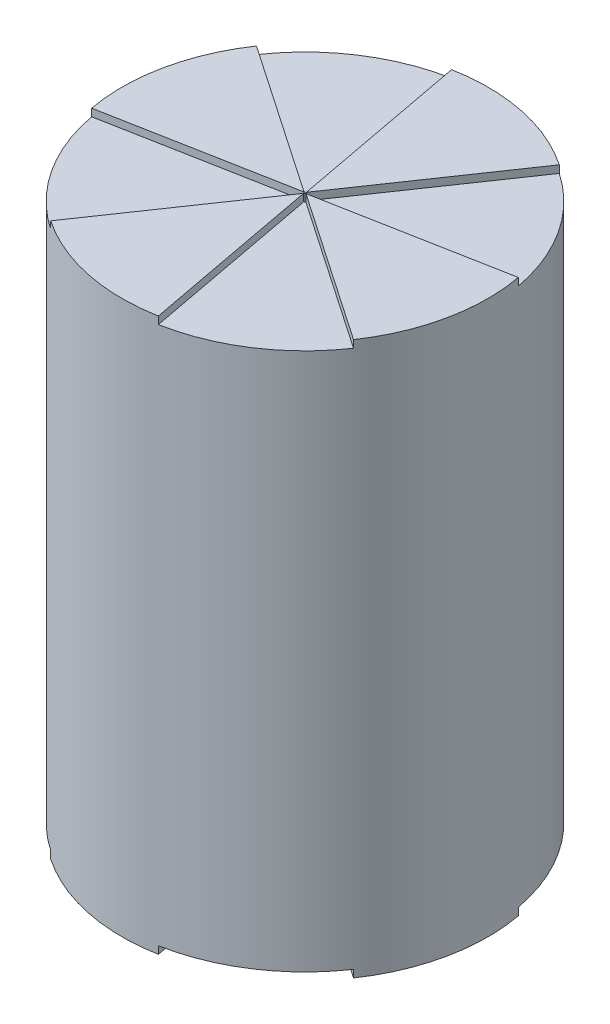
ISO-10303-21;
HEADER;
FILE_DESCRIPTION(('STEP AP214'),'2;1');
FILE_NAME('part.step','',(''),(''),'','','');
FILE_SCHEMA(('AUTOMOTIVE_DESIGN { 1 0 10303 214 1 1 1 1 }'));
ENDSEC;
DATA;
#1=APPLICATION_CONTEXT('core data for automotive mechanical design processes');
#2=APPLICATION_PROTOCOL_DEFINITION('international standard','automotive_design',2000,#1);
#3=PRODUCT_CONTEXT('',#1,'mechanical');
#4=PRODUCT('Part','Part','',(#3));
#5=PRODUCT_RELATED_PRODUCT_CATEGORY('part','',(#4));
#6=PRODUCT_DEFINITION_FORMATION('','',#4);
#7=PRODUCT_DEFINITION_CONTEXT('part definition',#1,'design');
#8=PRODUCT_DEFINITION('design','',#6,#7);
#9=PRODUCT_DEFINITION_SHAPE('','',#8);
#10=(LENGTH_UNIT() NAMED_UNIT(*) SI_UNIT(.MILLI.,.METRE.));
#11=(NAMED_UNIT(*) PLANE_ANGLE_UNIT() SI_UNIT($,.RADIAN.));
#12=(NAMED_UNIT(*) SI_UNIT($,.STERADIAN.) SOLID_ANGLE_UNIT());
#13=UNCERTAINTY_MEASURE_WITH_UNIT(LENGTH_MEASURE(1.E-05),#10,'distance_accuracy_value','');
#14=(GEOMETRIC_REPRESENTATION_CONTEXT(3) GLOBAL_UNCERTAINTY_ASSIGNED_CONTEXT((#13)) GLOBAL_UNIT_ASSIGNED_CONTEXT((#10,
#11,#12)) REPRESENTATION_CONTEXT('',''));
#15=CARTESIAN_POINT('',(0.,0.,0.));
#16=DIRECTION('',(0.,0.,1.));
#17=DIRECTION('',(1.,0.,0.));
#18=AXIS2_PLACEMENT_3D('',#15,#16,#17);
#19=CARTESIAN_POINT('',(0.,187.96,0.));
#20=DIRECTION('',(0.,-1.,0.));
#21=DIRECTION('',(0.,0.,-1.));
#22=AXIS2_PLACEMENT_3D('',#19,#20,#21);
#23=CYLINDRICAL_SURFACE('',#22,62.23);
#24=CARTESIAN_POINT('',(0.,185.42,0.));
#25=DIRECTION('',(0.,1.,0.));
#26=DIRECTION('',(-1.,0.,0.));
#27=AXIS2_PLACEMENT_3D('',#24,#25,#26);
#28=CIRCLE('',#27,62.23);
#29=CARTESIAN_POINT('',(11.3457915218461,185.42,61.1869750416116));
#30=VERTEX_POINT('',#29);
#31=CARTESIAN_POINT('',(51.4696538395341,185.42,34.9778163074617));
#32=VERTEX_POINT('',#31);
#33=EDGE_CURVE('E333',#30,#32,#28,.T.);
#34=ORIENTED_EDGE('',*,*,#33,.F.);
#35=DIRECTION('',(0.,1.,0.));
#36=VECTOR('',#35,1.);
#37=CARTESIAN_POINT('',(11.3457915218461,185.42,61.1869750416116));
#38=LINE('',#37,#36);
#39=CARTESIAN_POINT('',(11.3457915218461,187.96,61.1869750416116));
#40=VERTEX_POINT('',#39);
#41=EDGE_CURVE('E346',#30,#40,#38,.T.);
#42=ORIENTED_EDGE('',*,*,#41,.T.);
#43=CARTESIAN_POINT('',(0.,187.96,0.));
#44=DIRECTION('',(0.,1.,0.));
#45=DIRECTION('',(0.,0.,1.));
#46=AXIS2_PLACEMENT_3D('',#43,#44,#45);
#47=CIRCLE('',#46,62.23);
#48=CARTESIAN_POINT('',(-34.9778163074619,187.96,51.4696538395339));
#49=VERTEX_POINT('',#48);
#50=EDGE_CURVE('E11',#49,#40,#47,.T.);
#51=ORIENTED_EDGE('',*,*,#50,.F.);
#52=DIRECTION('',(0.,1.,0.));
#53=VECTOR('',#52,1.);
#54=CARTESIAN_POINT('',(-34.9778163074619,185.42,51.4696538395339));
#55=LINE('',#54,#53);
#56=CARTESIAN_POINT('',(-34.9778163074619,185.42,51.4696538395339));
#57=VERTEX_POINT('',#56);
#58=EDGE_CURVE('E59',#57,#49,#55,.T.);
#59=ORIENTED_EDGE('',*,*,#58,.F.);
#60=CARTESIAN_POINT('',(0.,185.42,0.));
#61=DIRECTION('',(0.,1.,0.));
#62=DIRECTION('',(0.,0.,-1.));
#63=AXIS2_PLACEMENT_3D('',#60,#61,#62);
#64=CIRCLE('',#63,62.23);
#65=CARTESIAN_POINT('',(-61.1869750416117,185.42,11.3457915218458));
#66=VERTEX_POINT('',#65);
#67=EDGE_CURVE('E357',#66,#57,#64,.T.);
#68=ORIENTED_EDGE('',*,*,#67,.F.);
#69=DIRECTION('',(0.,1.,0.));
#70=VECTOR('',#69,1.);
#71=CARTESIAN_POINT('',(-61.1869750416117,185.42,11.3457915218458));
#72=LINE('',#71,#70);
#73=CARTESIAN_POINT('',(-61.1869750416117,187.96,11.3457915218458));
#74=VERTEX_POINT('',#73);
#75=EDGE_CURVE('E375',#66,#74,#72,.T.);
#76=ORIENTED_EDGE('',*,*,#75,.T.);
#77=CARTESIAN_POINT('',(-51.4696538395343,187.96,-34.9778163074614));
#78=VERTEX_POINT('',#77);
#79=EDGE_CURVE('E44',#78,#74,#47,.T.);
#80=ORIENTED_EDGE('',*,*,#79,.F.);
#81=DIRECTION('',(0.,1.,0.));
#82=VECTOR('',#81,1.);
#83=CARTESIAN_POINT('',(-51.4696538395343,185.42,-34.9778163074614));
#84=LINE('',#83,#82);
#85=CARTESIAN_POINT('',(-51.4696538395343,185.42,-34.9778163074614));
#86=VERTEX_POINT('',#85);
#87=EDGE_CURVE('E303',#86,#78,#84,.T.);
#88=ORIENTED_EDGE('',*,*,#87,.F.);
#89=CARTESIAN_POINT('',(0.,185.42,0.));
#90=DIRECTION('',(0.,1.,0.));
#91=DIRECTION('',(1.,0.,0.));
#92=AXIS2_PLACEMENT_3D('',#89,#90,#91);
#93=CIRCLE('',#92,62.23);
#94=CARTESIAN_POINT('',(-11.3457915218465,185.42,-61.1869750416116));
#95=VERTEX_POINT('',#94);
#96=EDGE_CURVE('E294',#95,#86,#93,.T.);
#97=ORIENTED_EDGE('',*,*,#96,.F.);
#98=DIRECTION('',(0.,1.,0.));
#99=VECTOR('',#98,1.);
#100=CARTESIAN_POINT('',(-11.3457915218465,185.42,-61.1869750416116));
#101=LINE('',#100,#99);
#102=CARTESIAN_POINT('',(-11.3457915218465,187.96,-61.1869750416116));
#103=VERTEX_POINT('',#102);
#104=EDGE_CURVE('E306',#95,#103,#101,.T.);
#105=ORIENTED_EDGE('',*,*,#104,.T.);
#106=CARTESIAN_POINT('',(34.9778163074619,187.96,-51.4696538395339));
#107=VERTEX_POINT('',#106);
#108=EDGE_CURVE('E391',#107,#103,#47,.T.);
#109=ORIENTED_EDGE('',*,*,#108,.F.);
#110=DIRECTION('',(0.,1.,0.));
#111=VECTOR('',#110,1.);
#112=CARTESIAN_POINT('',(34.9778163074619,185.42,-51.4696538395339));
#113=LINE('',#112,#111);
#114=CARTESIAN_POINT('',(34.9778163074619,185.42,-51.4696538395339));
#115=VERTEX_POINT('',#114);
#116=EDGE_CURVE('E322',#115,#107,#113,.T.);
#117=ORIENTED_EDGE('',*,*,#116,.F.);
#118=CARTESIAN_POINT('',(0.,185.42,0.));
#119=DIRECTION('',(0.,1.,0.));
#120=DIRECTION('',(0.,0.,1.));
#121=AXIS2_PLACEMENT_3D('',#118,#119,#120);
#122=CIRCLE('',#121,62.23);
#123=CARTESIAN_POINT('',(61.1869750416117,185.42,-11.3457915218458));
#124=VERTEX_POINT('',#123);
#125=EDGE_CURVE('E313',#124,#115,#122,.T.);
#126=ORIENTED_EDGE('',*,*,#125,.F.);
#127=DIRECTION('',(0.,1.,0.));
#128=VECTOR('',#127,1.);
#129=CARTESIAN_POINT('',(61.1869750416117,185.42,-11.3457915218458));
#130=LINE('',#129,#128);
#131=CARTESIAN_POINT('',(61.1869750416117,187.96,-11.3457915218458));
#132=VERTEX_POINT('',#131);
#133=EDGE_CURVE('E326',#124,#132,#130,.T.);
#134=ORIENTED_EDGE('',*,*,#133,.T.);
#135=CARTESIAN_POINT('',(51.4696538395341,187.96,34.9778163074617));
#136=VERTEX_POINT('',#135);
#137=EDGE_CURVE('E43',#136,#132,#47,.T.);
#138=ORIENTED_EDGE('',*,*,#137,.F.);
#139=DIRECTION('',(0.,1.,0.));
#140=VECTOR('',#139,1.);
#141=CARTESIAN_POINT('',(51.4696538395341,185.42,34.9778163074617));
#142=LINE('',#141,#140);
#143=EDGE_CURVE('E342',#32,#136,#142,.T.);
#144=ORIENTED_EDGE('',*,*,#143,.F.);
#145=EDGE_LOOP('',(#34,#42,#51,#59,#68,#76,#80,#88,#97,#105,#109,#117,#126,#134,#138,#144));
#146=FACE_BOUND('',#145,.T.);
#147=DIRECTION('',(0.,-1.,0.));
#148=VECTOR('',#147,1.);
#149=CARTESIAN_POINT('',(-34.9778163074619,2.54,51.4696538395339));
#150=LINE('',#149,#148);
#151=CARTESIAN_POINT('',(-34.9778163074619,2.54,51.4696538395339));
#152=VERTEX_POINT('',#151);
#153=CARTESIAN_POINT('',(-34.9778163074619,0.,51.4696538395339));
#154=VERTEX_POINT('',#153);
#155=EDGE_CURVE('E290',#152,#154,#150,.T.);
#156=ORIENTED_EDGE('',*,*,#155,.T.);
#157=CARTESIAN_POINT('',(0.,0.,0.));
#158=DIRECTION('',(0.,1.,0.));
#159=DIRECTION('',(0.,0.,1.));
#160=AXIS2_PLACEMENT_3D('',#157,#158,#159);
#161=CIRCLE('',#160,62.23);
#162=CARTESIAN_POINT('',(11.3457915218461,0.,61.1869750416116));
#163=VERTEX_POINT('',#162);
#164=EDGE_CURVE('E38',#154,#163,#161,.T.);
#165=ORIENTED_EDGE('',*,*,#164,.T.);
#166=DIRECTION('',(0.,-1.,0.));
#167=VECTOR('',#166,1.);
#168=CARTESIAN_POINT('',(11.3457915218461,2.54,61.1869750416116));
#169=LINE('',#168,#167);
#170=CARTESIAN_POINT('',(11.3457915218461,2.54,61.1869750416116));
#171=VERTEX_POINT('',#170);
#172=EDGE_CURVE('E254',#171,#163,#169,.T.);
#173=ORIENTED_EDGE('',*,*,#172,.F.);
#174=CARTESIAN_POINT('',(0.,2.54,0.));
#175=DIRECTION('',(0.,1.,0.));
#176=DIRECTION('',(-1.,0.,0.));
#177=AXIS2_PLACEMENT_3D('',#174,#175,#176);
#178=CIRCLE('',#177,62.23);
#179=CARTESIAN_POINT('',(51.4696538395341,2.54,34.9778163074617));
#180=VERTEX_POINT('',#179);
#181=EDGE_CURVE('E245',#171,#180,#178,.T.);
#182=ORIENTED_EDGE('',*,*,#181,.T.);
#183=DIRECTION('',(0.,-1.,0.));
#184=VECTOR('',#183,1.);
#185=CARTESIAN_POINT('',(51.4696538395341,2.54,34.9778163074617));
#186=LINE('',#185,#184);
#187=CARTESIAN_POINT('',(51.4696538395341,0.,34.9778163074617));
#188=VERTEX_POINT('',#187);
#189=EDGE_CURVE('E259',#180,#188,#186,.T.);
#190=ORIENTED_EDGE('',*,*,#189,.T.);
#191=CARTESIAN_POINT('',(61.1869750416117,0.,-11.3457915218458));
#192=VERTEX_POINT('',#191);
#193=EDGE_CURVE('E384',#188,#192,#161,.T.);
#194=ORIENTED_EDGE('',*,*,#193,.T.);
#195=DIRECTION('',(0.,-1.,0.));
#196=VECTOR('',#195,1.);
#197=CARTESIAN_POINT('',(61.1869750416117,2.54,-11.3457915218458));
#198=LINE('',#197,#196);
#199=CARTESIAN_POINT('',(61.1869750416117,2.54,-11.3457915218458));
#200=VERTEX_POINT('',#199);
#201=EDGE_CURVE('E234',#200,#192,#198,.T.);
#202=ORIENTED_EDGE('',*,*,#201,.F.);
#203=CARTESIAN_POINT('',(0.,2.54,0.));
#204=DIRECTION('',(0.,1.,0.));
#205=DIRECTION('',(0.,0.,1.));
#206=AXIS2_PLACEMENT_3D('',#203,#204,#205);
#207=CIRCLE('',#206,62.23);
#208=CARTESIAN_POINT('',(34.9778163074619,2.54,-51.4696538395339));
#209=VERTEX_POINT('',#208);
#210=EDGE_CURVE('E226',#200,#209,#207,.T.);
#211=ORIENTED_EDGE('',*,*,#210,.T.);
#212=DIRECTION('',(0.,-1.,0.));
#213=VECTOR('',#212,1.);
#214=CARTESIAN_POINT('',(34.9778163074619,2.54,-51.4696538395339));
#215=LINE('',#214,#213);
#216=CARTESIAN_POINT('',(34.9778163074619,0.,-51.4696538395339));
#217=VERTEX_POINT('',#216);
#218=EDGE_CURVE('E239',#209,#217,#215,.T.);
#219=ORIENTED_EDGE('',*,*,#218,.T.);
#220=CARTESIAN_POINT('',(-11.3457915218465,0.,-61.1869750416116));
#221=VERTEX_POINT('',#220);
#222=EDGE_CURVE('E218',#217,#221,#161,.T.);
#223=ORIENTED_EDGE('',*,*,#222,.T.);
#224=DIRECTION('',(0.,-1.,0.));
#225=VECTOR('',#224,1.);
#226=CARTESIAN_POINT('',(-11.3457915218465,2.54,-61.1869750416116));
#227=LINE('',#226,#225);
#228=CARTESIAN_POINT('',(-11.3457915218465,2.54,-61.1869750416116));
#229=VERTEX_POINT('',#228);
#230=EDGE_CURVE('E51',#229,#221,#227,.T.);
#231=ORIENTED_EDGE('',*,*,#230,.F.);
#232=CARTESIAN_POINT('',(0.,2.54,0.));
#233=DIRECTION('',(0.,1.,0.));
#234=DIRECTION('',(1.,0.,0.));
#235=AXIS2_PLACEMENT_3D('',#232,#233,#234);
#236=CIRCLE('',#235,62.23);
#237=CARTESIAN_POINT('',(-51.4696538395343,2.54,-34.9778163074614));
#238=VERTEX_POINT('',#237);
#239=EDGE_CURVE('E204',#229,#238,#236,.T.);
#240=ORIENTED_EDGE('',*,*,#239,.T.);
#241=DIRECTION('',(0.,-1.,0.));
#242=VECTOR('',#241,1.);
#243=CARTESIAN_POINT('',(-51.4696538395343,2.54,-34.9778163074614));
#244=LINE('',#243,#242);
#245=CARTESIAN_POINT('',(-51.4696538395343,0.,-34.9778163074614));
#246=VERTEX_POINT('',#245);
#247=EDGE_CURVE('E219',#238,#246,#244,.T.);
#248=ORIENTED_EDGE('',*,*,#247,.T.);
#249=CARTESIAN_POINT('',(-61.1869750416117,0.,11.3457915218458));
#250=VERTEX_POINT('',#249);
#251=EDGE_CURVE('E383',#246,#250,#161,.T.);
#252=ORIENTED_EDGE('',*,*,#251,.T.);
#253=DIRECTION('',(0.,-1.,0.));
#254=VECTOR('',#253,1.);
#255=CARTESIAN_POINT('',(-61.1869750416117,2.54,11.3457915218458));
#256=LINE('',#255,#254);
#257=CARTESIAN_POINT('',(-61.1869750416117,2.54,11.3457915218458));
#258=VERTEX_POINT('',#257);
#259=EDGE_CURVE('E282',#258,#250,#256,.T.);
#260=ORIENTED_EDGE('',*,*,#259,.F.);
#261=CARTESIAN_POINT('',(0.,2.54,0.));
#262=DIRECTION('',(0.,1.,0.));
#263=DIRECTION('',(0.,0.,-1.));
#264=AXIS2_PLACEMENT_3D('',#261,#262,#263);
#265=CIRCLE('',#264,62.23);
#266=EDGE_CURVE('E270',#258,#152,#265,.T.);
#267=ORIENTED_EDGE('',*,*,#266,.T.);
#268=EDGE_LOOP('',(#156,#165,#173,#182,#190,#194,#202,#211,#219,#223,#231,#240,#248,#252,#260,#267));
#269=FACE_BOUND('',#268,.T.);
#270=ADVANCED_FACE('F35',(#146,#269),#23,.T.);
#271=CARTESIAN_POINT('',(0.,0.,0.));
#272=DIRECTION('',(0.,1.,0.));
#273=DIRECTION('',(0.,0.,1.));
#274=AXIS2_PLACEMENT_3D('',#271,#272,#273);
#275=PLANE('',#274);
#276=DIRECTION('',(0.56420608270553,0.,-0.825633996537255));
#277=VECTOR('',#276,1.);
#278=CARTESIAN_POINT('',(-34.9778163074619,0.,51.4696538395339));
#279=LINE('',#278,#277);
#280=CARTESIAN_POINT('',(-0.0861680748122756,0.,0.410773300789611));
#281=VERTEX_POINT('',#280);
#282=EDGE_CURVE('E274',#154,#281,#279,.T.);
#283=ORIENTED_EDGE('',*,*,#282,.T.);
#284=DIRECTION('',(0.184857450661874,0.,0.982765344797421));
#285=VECTOR('',#284,1.);
#286=CARTESIAN_POINT('',(-0.121475110096735,0.,0.223069042287327));
#287=LINE('',#286,#285);
#288=EDGE_CURVE('E244',#281,#163,#287,.T.);
#289=ORIENTED_EDGE('',*,*,#288,.T.);
#290=ORIENTED_EDGE('',*,*,#164,.F.);
#291=EDGE_LOOP('',(#283,#289,#290));
#292=FACE_BOUND('',#291,.T.);
#293=ADVANCED_FACE('F450',(#292),#275,.F.);
#294=DIRECTION('',(-0.982765344797421,0.,0.18485745066187));
#295=VECTOR('',#294,1.);
#296=CARTESIAN_POINT('',(-0.223069042287327,0.,-0.121475110096735));
#297=LINE('',#296,#295);
#298=CARTESIAN_POINT('',(-0.410773300789609,0.,-0.086168074812274));
#299=VERTEX_POINT('',#298);
#300=EDGE_CURVE('E269',#299,#250,#297,.T.);
#301=ORIENTED_EDGE('',*,*,#300,.T.);
#302=ORIENTED_EDGE('',*,*,#251,.F.);
#303=DIRECTION('',(0.825633996537261,0.,0.564206082705522));
#304=VECTOR('',#303,1.);
#305=CARTESIAN_POINT('',(-51.4696538395343,0.,-34.9778163074614));
#306=LINE('',#305,#304);
#307=EDGE_CURVE('E212',#246,#299,#306,.T.);
#308=ORIENTED_EDGE('',*,*,#307,.T.);
#309=EDGE_LOOP('',(#301,#302,#308));
#310=FACE_BOUND('',#309,.T.);
#311=ADVANCED_FACE('F454',(#310),#275,.F.);
#312=DIRECTION('',(-0.825633996537257,0.,-0.564206082705527));
#313=VECTOR('',#312,1.);
#314=CARTESIAN_POINT('',(51.4696538395341,0.,34.9778163074617));
#315=LINE('',#314,#313);
#316=CARTESIAN_POINT('',(0.410773300789592,0.,0.086168074812271));
#317=VERTEX_POINT('',#316);
#318=EDGE_CURVE('E249',#188,#317,#315,.T.);
#319=ORIENTED_EDGE('',*,*,#318,.T.);
#320=DIRECTION('',(0.982765344797421,0.,-0.18485745066187));
#321=VECTOR('',#320,1.);
#322=CARTESIAN_POINT('',(0.223069042287327,0.,0.121475110096735));
#323=LINE('',#322,#321);
#324=EDGE_CURVE('E221',#317,#192,#323,.T.);
#325=ORIENTED_EDGE('',*,*,#324,.T.);
#326=ORIENTED_EDGE('',*,*,#193,.F.);
#327=EDGE_LOOP('',(#319,#325,#326));
#328=FACE_BOUND('',#327,.T.);
#329=ADVANCED_FACE('F460',(#328),#275,.F.);
#330=DIRECTION('',(-0.56420608270553,0.,0.825633996537255));
#331=VECTOR('',#330,1.);
#332=CARTESIAN_POINT('',(34.9778163074619,0.,-51.4696538395339));
#333=LINE('',#332,#331);
#334=CARTESIAN_POINT('',(0.086168074812272,0.,-0.410773300789591));
#335=VERTEX_POINT('',#334);
#336=EDGE_CURVE('E230',#217,#335,#333,.T.);
#337=ORIENTED_EDGE('',*,*,#336,.T.);
#338=DIRECTION('',(-0.184857450661881,0.,-0.982765344797419));
#339=VECTOR('',#338,1.);
#340=CARTESIAN_POINT('',(0.121475110096733,0.,-0.223069042287328));
#341=LINE('',#340,#339);
#342=EDGE_CURVE('E477',#335,#221,#341,.T.);
#343=ORIENTED_EDGE('',*,*,#342,.T.);
#344=ORIENTED_EDGE('',*,*,#222,.F.);
#345=EDGE_LOOP('',(#337,#343,#344));
#346=FACE_BOUND('',#345,.T.);
#347=ADVANCED_FACE('F464',(#346),#275,.F.);
#348=CARTESIAN_POINT('',(0.,187.96,0.));
#349=DIRECTION('',(0.,1.,0.));
#350=DIRECTION('',(0.,0.,1.));
#351=AXIS2_PLACEMENT_3D('',#348,#349,#350);
#352=PLANE('',#351);
#353=DIRECTION('',(0.184857450661874,0.,0.982765344797421));
#354=VECTOR('',#353,1.);
#355=CARTESIAN_POINT('',(-0.121475110096735,187.96,0.223069042287327));
#356=LINE('',#355,#354);
#357=CARTESIAN_POINT('',(-0.0861680748122707,187.96,0.410773300789586));
#358=VERTEX_POINT('',#357);
#359=EDGE_CURVE('E337',#358,#40,#356,.T.);
#360=ORIENTED_EDGE('',*,*,#359,.F.);
#361=DIRECTION('',(0.56420608270553,0.,-0.825633996537255));
#362=VECTOR('',#361,1.);
#363=CARTESIAN_POINT('',(-34.9778163074619,187.96,51.4696538395339));
#364=LINE('',#363,#362);
#365=EDGE_CURVE('E356',#49,#358,#364,.T.);
#366=ORIENTED_EDGE('',*,*,#365,.F.);
#367=ORIENTED_EDGE('',*,*,#50,.T.);
#368=EDGE_LOOP('',(#360,#366,#367));
#369=FACE_BOUND('',#368,.T.);
#370=ADVANCED_FACE('F424',(#369),#352,.T.);
#371=CARTESIAN_POINT('',(0.,187.96,0.));
#372=DIRECTION('',(0.,-1.,0.));
#373=DIRECTION('',(0.,0.,-1.));
#374=AXIS2_PLACEMENT_3D('',#371,#372,#373);
#375=CIRCLE('',#374,0.253999999999998);
#376=CARTESIAN_POINT('',(0.,187.96,-0.253999999999998));
#377=VERTEX_POINT('',#376);
#378=EDGE_CURVE('E370',#377,#377,#375,.T.);
#379=ORIENTED_EDGE('',*,*,#378,.F.);
#380=EDGE_LOOP('',(#379));
#381=FACE_BOUND('',#380,.T.);
#382=ADVANCED_FACE('F447',(#381),#352,.T.);
#383=DIRECTION('',(-0.825633996537257,0.,-0.564206082705527));
#384=VECTOR('',#383,1.);
#385=CARTESIAN_POINT('',(51.4696538395341,187.96,34.9778163074617));
#386=LINE('',#385,#384);
#387=CARTESIAN_POINT('',(0.410773300789593,187.96,0.0861680748122769));
#388=VERTEX_POINT('',#387);
#389=EDGE_CURVE('E332',#136,#388,#386,.T.);
#390=ORIENTED_EDGE('',*,*,#389,.F.);
#391=ORIENTED_EDGE('',*,*,#137,.T.);
#392=DIRECTION('',(0.982765344797421,0.,-0.18485745066187));
#393=VECTOR('',#392,1.);
#394=CARTESIAN_POINT('',(0.223069042287327,187.96,0.121475110096735));
#395=LINE('',#394,#393);
#396=EDGE_CURVE('E317',#388,#132,#395,.T.);
#397=ORIENTED_EDGE('',*,*,#396,.F.);
#398=EDGE_LOOP('',(#390,#391,#397));
#399=FACE_BOUND('',#398,.T.);
#400=ADVANCED_FACE('F405',(#399),#352,.T.);
#401=DIRECTION('',(-0.56420608270553,0.,0.825633996537255));
#402=VECTOR('',#401,1.);
#403=CARTESIAN_POINT('',(34.9778163074619,187.96,-51.4696538395339));
#404=LINE('',#403,#402);
#405=CARTESIAN_POINT('',(0.0861680748122732,187.96,-0.410773300789591));
#406=VERTEX_POINT('',#405);
#407=EDGE_CURVE('E312',#107,#406,#404,.T.);
#408=ORIENTED_EDGE('',*,*,#407,.F.);
#409=ORIENTED_EDGE('',*,*,#108,.T.);
#410=DIRECTION('',(-0.184857450661881,0.,-0.982765344797419));
#411=VECTOR('',#410,1.);
#412=CARTESIAN_POINT('',(0.121475110096733,187.96,-0.223069042287328));
#413=LINE('',#412,#411);
#414=EDGE_CURVE('E298',#406,#103,#413,.T.);
#415=ORIENTED_EDGE('',*,*,#414,.F.);
#416=EDGE_LOOP('',(#408,#409,#415));
#417=FACE_BOUND('',#416,.T.);
#418=ADVANCED_FACE('F440',(#417),#352,.T.);
#419=DIRECTION('',(0.825633996537261,0.,0.564206082705522));
#420=VECTOR('',#419,1.);
#421=CARTESIAN_POINT('',(-51.4696538395343,187.96,-34.9778163074614));
#422=LINE('',#421,#420);
#423=CARTESIAN_POINT('',(-0.410773300789619,187.96,-0.0861680748122789));
#424=VERTEX_POINT('',#423);
#425=EDGE_CURVE('E292',#78,#424,#422,.T.);
#426=ORIENTED_EDGE('',*,*,#425,.F.);
#427=ORIENTED_EDGE('',*,*,#79,.T.);
#428=DIRECTION('',(-0.982765344797421,0.,0.18485745066187));
#429=VECTOR('',#428,1.);
#430=CARTESIAN_POINT('',(-0.223069042287327,187.96,-0.121475110096735));
#431=LINE('',#430,#429);
#432=EDGE_CURVE('E361',#424,#74,#431,.T.);
#433=ORIENTED_EDGE('',*,*,#432,.F.);
#434=EDGE_LOOP('',(#426,#427,#433));
#435=FACE_BOUND('',#434,.T.);
#436=ADVANCED_FACE('F429',(#435),#352,.T.);
#437=CARTESIAN_POINT('',(-0.223069042287327,185.42,-0.121475110096735));
#438=DIRECTION('',(-0.18485745066187,0.,-0.982765344797421));
#439=DIRECTION('',(-0.982765344797421,0.,0.18485745066187));
#440=AXIS2_PLACEMENT_3D('',#437,#438,#439);
#441=PLANE('',#440);
#442=DIRECTION('',(-0.982765344797421,0.,0.18485745066187));
#443=VECTOR('',#442,1.);
#444=CARTESIAN_POINT('',(-0.223069042287327,185.42,-0.121475110096735));
#445=LINE('',#444,#443);
#446=CARTESIAN_POINT('',(-0.410773300789619,185.42,-0.0861680748122789));
#447=VERTEX_POINT('',#446);
#448=EDGE_CURVE('E367',#447,#66,#445,.T.);
#449=ORIENTED_EDGE('',*,*,#448,.F.);
#450=DIRECTION('',(0.,1.,0.));
#451=VECTOR('',#450,1.);
#452=CARTESIAN_POINT('',(-0.41077330078961,185.42,-0.0861680748122737));
#453=LINE('',#452,#451);
#454=EDGE_CURVE('E349',#447,#424,#453,.T.);
#455=ORIENTED_EDGE('',*,*,#454,.T.);
#456=ORIENTED_EDGE('',*,*,#432,.T.);
#457=ORIENTED_EDGE('',*,*,#75,.F.);
#458=EDGE_LOOP('',(#449,#455,#456,#457));
#459=FACE_BOUND('',#458,.T.);
#460=ADVANCED_FACE('F428',(#459),#441,.F.);
#461=CARTESIAN_POINT('',(0.,185.42,0.));
#462=DIRECTION('',(0.,1.,0.));
#463=DIRECTION('',(0.,0.,1.));
#464=AXIS2_PLACEMENT_3D('',#461,#462,#463);
#465=CYLINDRICAL_SURFACE('',#464,0.253999999999998);
#466=ORIENTED_EDGE('',*,*,#378,.T.);
#467=EDGE_LOOP('',(#466));
#468=FACE_BOUND('',#467,.T.);
#469=CARTESIAN_POINT('',(0.,185.42,0.));
#470=DIRECTION('',(0.,-1.,0.));
#471=DIRECTION('',(0.,0.,-1.));
#472=AXIS2_PLACEMENT_3D('',#469,#470,#471);
#473=CIRCLE('',#472,0.253999999999998);
#474=CARTESIAN_POINT('',(0.,185.42,-0.253999999999998));
#475=VERTEX_POINT('',#474);
#476=EDGE_CURVE('E364',#475,#475,#473,.T.);
#477=ORIENTED_EDGE('',*,*,#476,.F.);
#478=EDGE_LOOP('',(#477));
#479=FACE_BOUND('',#478,.T.);
#480=ADVANCED_FACE('F547',(#468,#479),#465,.T.);
#481=CARTESIAN_POINT('',(-34.9778163074619,185.42,51.4696538395339));
#482=DIRECTION('',(0.825633996537255,0.,0.56420608270553));
#483=DIRECTION('',(0.56420608270553,0.,-0.825633996537255));
#484=AXIS2_PLACEMENT_3D('',#481,#482,#483);
#485=PLANE('',#484);
#486=ORIENTED_EDGE('',*,*,#365,.T.);
#487=DIRECTION('',(0.,-1.,0.));
#488=VECTOR('',#487,1.);
#489=CARTESIAN_POINT('',(-0.086168074812272,185.42,0.410773300789605));
#490=LINE('',#489,#488);
#491=CARTESIAN_POINT('',(-0.0861680748122723,185.42,0.41077330078961));
#492=VERTEX_POINT('',#491);
#493=EDGE_CURVE('E353',#358,#492,#490,.T.);
#494=ORIENTED_EDGE('',*,*,#493,.T.);
#495=DIRECTION('',(0.56420608270553,0.,-0.825633996537255));
#496=VECTOR('',#495,1.);
#497=CARTESIAN_POINT('',(-34.9778163074619,185.42,51.4696538395339));
#498=LINE('',#497,#496);
#499=EDGE_CURVE('E360',#57,#492,#498,.T.);
#500=ORIENTED_EDGE('',*,*,#499,.F.);
#501=ORIENTED_EDGE('',*,*,#58,.T.);
#502=EDGE_LOOP('',(#486,#494,#500,#501));
#503=FACE_BOUND('',#502,.T.);
#504=ADVANCED_FACE('F425',(#503),#485,.F.);
#505=CARTESIAN_POINT('',(0.,185.42,0.));
#506=DIRECTION('',(0.,-1.,0.));
#507=DIRECTION('',(0.,0.,-1.));
#508=AXIS2_PLACEMENT_3D('',#505,#506,#507);
#509=PLANE('',#508);
#510=DIRECTION('',(0.825633996537261,0.,0.564206082705522));
#511=VECTOR('',#510,1.);
#512=CARTESIAN_POINT('',(-51.4696538395343,185.42,-34.9778163074614));
#513=LINE('',#512,#511);
#514=EDGE_CURVE('E297',#86,#447,#513,.T.);
#515=ORIENTED_EDGE('',*,*,#514,.T.);
#516=ORIENTED_EDGE('',*,*,#448,.T.);
#517=ORIENTED_EDGE('',*,*,#67,.T.);
#518=ORIENTED_EDGE('',*,*,#499,.T.);
#519=DIRECTION('',(0.184857450661874,0.,0.982765344797421));
#520=VECTOR('',#519,1.);
#521=CARTESIAN_POINT('',(-0.121475110096735,185.42,0.223069042287327));
#522=LINE('',#521,#520);
#523=EDGE_CURVE('E340',#492,#30,#522,.T.);
#524=ORIENTED_EDGE('',*,*,#523,.T.);
#525=ORIENTED_EDGE('',*,*,#33,.T.);
#526=DIRECTION('',(-0.825633996537257,0.,-0.564206082705527));
#527=VECTOR('',#526,1.);
#528=CARTESIAN_POINT('',(51.4696538395341,185.42,34.9778163074617));
#529=LINE('',#528,#527);
#530=CARTESIAN_POINT('',(0.410773300789593,185.42,0.0861680748122769));
#531=VERTEX_POINT('',#530);
#532=EDGE_CURVE('E336',#32,#531,#529,.T.);
#533=ORIENTED_EDGE('',*,*,#532,.T.);
#534=DIRECTION('',(0.982765344797421,0.,-0.18485745066187));
#535=VECTOR('',#534,1.);
#536=CARTESIAN_POINT('',(0.223069042287327,185.42,0.121475110096735));
#537=LINE('',#536,#535);
#538=EDGE_CURVE('E320',#531,#124,#537,.T.);
#539=ORIENTED_EDGE('',*,*,#538,.T.);
#540=ORIENTED_EDGE('',*,*,#125,.T.);
#541=DIRECTION('',(-0.56420608270553,0.,0.825633996537255));
#542=VECTOR('',#541,1.);
#543=CARTESIAN_POINT('',(34.9778163074619,185.42,-51.4696538395339));
#544=LINE('',#543,#542);
#545=CARTESIAN_POINT('',(0.0861680748122732,185.42,-0.410773300789591));
#546=VERTEX_POINT('',#545);
#547=EDGE_CURVE('E316',#115,#546,#544,.T.);
#548=ORIENTED_EDGE('',*,*,#547,.T.);
#549=DIRECTION('',(-0.184857450661881,0.,-0.982765344797419));
#550=VECTOR('',#549,1.);
#551=CARTESIAN_POINT('',(0.121475110096733,185.42,-0.223069042287328));
#552=LINE('',#551,#550);
#553=EDGE_CURVE('E301',#546,#95,#552,.T.);
#554=ORIENTED_EDGE('',*,*,#553,.T.);
#555=ORIENTED_EDGE('',*,*,#96,.T.);
#556=EDGE_LOOP('',(#515,#516,#517,#518,#524,#525,#533,#539,#540,#548,#554,#555));
#557=FACE_BOUND('',#556,.T.);
#558=ORIENTED_EDGE('',*,*,#476,.T.);
#559=EDGE_LOOP('',(#558));
#560=FACE_BOUND('',#559,.T.);
#561=ADVANCED_FACE('F417',(#557,#560),#509,.F.);
#562=CARTESIAN_POINT('',(-0.121475110096735,185.42,0.223069042287327));
#563=DIRECTION('',(-0.98276534479742,0.,0.184857450661874));
#564=DIRECTION('',(0.184857450661874,0.,0.982765344797421));
#565=AXIS2_PLACEMENT_3D('',#562,#563,#564);
#566=PLANE('',#565);
#567=ORIENTED_EDGE('',*,*,#359,.T.);
#568=ORIENTED_EDGE('',*,*,#41,.F.);
#569=ORIENTED_EDGE('',*,*,#523,.F.);
#570=ORIENTED_EDGE('',*,*,#493,.F.);
#571=EDGE_LOOP('',(#567,#568,#569,#570));
#572=FACE_BOUND('',#571,.T.);
#573=ADVANCED_FACE('F534',(#572),#566,.F.);
#574=CARTESIAN_POINT('',(-51.4696538395343,185.42,-34.9778163074614));
#575=DIRECTION('',(-0.564206082705522,0.,0.825633996537261));
#576=DIRECTION('',(0.825633996537261,0.,0.564206082705522));
#577=AXIS2_PLACEMENT_3D('',#574,#575,#576);
#578=PLANE('',#577);
#579=ORIENTED_EDGE('',*,*,#514,.F.);
#580=ORIENTED_EDGE('',*,*,#87,.T.);
#581=ORIENTED_EDGE('',*,*,#425,.T.);
#582=ORIENTED_EDGE('',*,*,#454,.F.);
#583=EDGE_LOOP('',(#579,#580,#581,#582));
#584=FACE_BOUND('',#583,.T.);
#585=ADVANCED_FACE('F433',(#584),#578,.F.);
#586=CARTESIAN_POINT('',(51.4696538395341,185.42,34.9778163074617));
#587=DIRECTION('',(0.564206082705527,0.,-0.825633996537257));
#588=DIRECTION('',(-0.825633996537257,0.,-0.564206082705528));
#589=AXIS2_PLACEMENT_3D('',#586,#587,#588);
#590=PLANE('',#589);
#591=DIRECTION('',(0.,-1.,0.));
#592=VECTOR('',#591,1.);
#593=CARTESIAN_POINT('',(0.410773300789598,185.42,0.086168074812272));
#594=LINE('',#593,#592);
#595=EDGE_CURVE('E329',#388,#531,#594,.T.);
#596=ORIENTED_EDGE('',*,*,#595,.T.);
#597=ORIENTED_EDGE('',*,*,#532,.F.);
#598=ORIENTED_EDGE('',*,*,#143,.T.);
#599=ORIENTED_EDGE('',*,*,#389,.T.);
#600=EDGE_LOOP('',(#596,#597,#598,#599));
#601=FACE_BOUND('',#600,.T.);
#602=ADVANCED_FACE('F415',(#601),#590,.F.);
#603=CARTESIAN_POINT('',(0.223069042287327,185.42,0.121475110096735));
#604=DIRECTION('',(0.18485745066187,0.,0.982765344797421));
#605=DIRECTION('',(0.982765344797421,0.,-0.18485745066187));
#606=AXIS2_PLACEMENT_3D('',#603,#604,#605);
#607=PLANE('',#606);
#608=ORIENTED_EDGE('',*,*,#396,.T.);
#609=ORIENTED_EDGE('',*,*,#133,.F.);
#610=ORIENTED_EDGE('',*,*,#538,.F.);
#611=ORIENTED_EDGE('',*,*,#595,.F.);
#612=EDGE_LOOP('',(#608,#609,#610,#611));
#613=FACE_BOUND('',#612,.T.);
#614=ADVANCED_FACE('F413',(#613),#607,.F.);
#615=CARTESIAN_POINT('',(34.9778163074619,185.42,-51.4696538395339));
#616=DIRECTION('',(-0.825633996537255,0.,-0.56420608270553));
#617=DIRECTION('',(-0.56420608270553,0.,0.825633996537255));
#618=AXIS2_PLACEMENT_3D('',#615,#616,#617);
#619=PLANE('',#618);
#620=DIRECTION('',(0.,-1.,0.));
#621=VECTOR('',#620,1.);
#622=CARTESIAN_POINT('',(0.086168074812272,185.42,-0.410773300789598));
#623=LINE('',#622,#621);
#624=EDGE_CURVE('E309',#406,#546,#623,.T.);
#625=ORIENTED_EDGE('',*,*,#624,.T.);
#626=ORIENTED_EDGE('',*,*,#547,.F.);
#627=ORIENTED_EDGE('',*,*,#116,.T.);
#628=ORIENTED_EDGE('',*,*,#407,.T.);
#629=EDGE_LOOP('',(#625,#626,#627,#628));
#630=FACE_BOUND('',#629,.T.);
#631=ADVANCED_FACE('F439',(#630),#619,.F.);
#632=CARTESIAN_POINT('',(0.121475110096733,185.42,-0.223069042287328));
#633=DIRECTION('',(0.982765344797419,0.,-0.184857450661881));
#634=DIRECTION('',(-0.184857450661881,0.,-0.982765344797419));
#635=AXIS2_PLACEMENT_3D('',#632,#633,#634);
#636=PLANE('',#635);
#637=ORIENTED_EDGE('',*,*,#414,.T.);
#638=ORIENTED_EDGE('',*,*,#104,.F.);
#639=ORIENTED_EDGE('',*,*,#553,.F.);
#640=ORIENTED_EDGE('',*,*,#624,.F.);
#641=EDGE_LOOP('',(#637,#638,#639,#640));
#642=FACE_BOUND('',#641,.T.);
#643=ADVANCED_FACE('F437',(#642),#636,.F.);
#644=CARTESIAN_POINT('',(-34.9778163074619,2.54,51.4696538395339));
#645=DIRECTION('',(-0.825633996537255,0.,-0.56420608270553));
#646=DIRECTION('',(-0.56420608270553,0.,0.825633996537255));
#647=AXIS2_PLACEMENT_3D('',#644,#645,#646);
#648=PLANE('',#647);
#649=DIRECTION('',(0.,-1.,0.));
#650=VECTOR('',#649,1.);
#651=CARTESIAN_POINT('',(-0.086168074812272,2.54,0.410773300789605));
#652=LINE('',#651,#650);
#653=CARTESIAN_POINT('',(-0.0861680748122756,2.54,0.410773300789611));
#654=VERTEX_POINT('',#653);
#655=EDGE_CURVE('E267',#654,#281,#652,.T.);
#656=ORIENTED_EDGE('',*,*,#655,.T.);
#657=ORIENTED_EDGE('',*,*,#282,.F.);
#658=ORIENTED_EDGE('',*,*,#155,.F.);
#659=DIRECTION('',(0.56420608270553,0.,-0.825633996537255));
#660=VECTOR('',#659,1.);
#661=CARTESIAN_POINT('',(-34.9778163074619,2.54,51.4696538395339));
#662=LINE('',#661,#660);
#663=EDGE_CURVE('E279',#152,#654,#662,.T.);
#664=ORIENTED_EDGE('',*,*,#663,.T.);
#665=EDGE_LOOP('',(#656,#657,#658,#664));
#666=FACE_BOUND('',#665,.T.);
#667=ADVANCED_FACE('F496',(#666),#648,.T.);
#668=CARTESIAN_POINT('',(-0.223069042287327,2.54,-0.121475110096735));
#669=DIRECTION('',(0.18485745066187,0.,0.982765344797421));
#670=DIRECTION('',(0.982765344797421,0.,-0.18485745066187));
#671=AXIS2_PLACEMENT_3D('',#668,#669,#670);
#672=PLANE('',#671);
#673=DIRECTION('',(0.,1.,0.));
#674=VECTOR('',#673,1.);
#675=CARTESIAN_POINT('',(-0.41077330078961,2.54,-0.0861680748122737));
#676=LINE('',#675,#674);
#677=CARTESIAN_POINT('',(-0.410773300789619,2.54,-0.0861680748122789));
#678=VERTEX_POINT('',#677);
#679=EDGE_CURVE('E264',#299,#678,#676,.T.);
#680=ORIENTED_EDGE('',*,*,#679,.T.);
#681=DIRECTION('',(-0.982765344797421,0.,0.18485745066187));
#682=VECTOR('',#681,1.);
#683=CARTESIAN_POINT('',(-0.223069042287327,2.54,-0.121475110096735));
#684=LINE('',#683,#682);
#685=EDGE_CURVE('E273',#678,#258,#684,.T.);
#686=ORIENTED_EDGE('',*,*,#685,.T.);
#687=ORIENTED_EDGE('',*,*,#259,.T.);
#688=ORIENTED_EDGE('',*,*,#300,.F.);
#689=EDGE_LOOP('',(#680,#686,#687,#688));
#690=FACE_BOUND('',#689,.T.);
#691=ADVANCED_FACE('F500',(#690),#672,.T.);
#692=CARTESIAN_POINT('',(0.,2.54,0.));
#693=DIRECTION('',(0.,-1.,0.));
#694=DIRECTION('',(0.,0.,-1.));
#695=AXIS2_PLACEMENT_3D('',#692,#693,#694);
#696=CYLINDRICAL_SURFACE('',#695,0.253999999999998);
#697=CARTESIAN_POINT('',(0.,0.,0.));
#698=DIRECTION('',(0.,-1.,0.));
#699=DIRECTION('',(0.,0.,-1.));
#700=AXIS2_PLACEMENT_3D('',#697,#698,#699);
#701=CIRCLE('',#700,0.253999999999998);
#702=CARTESIAN_POINT('',(0.,0.,-0.253999999999998));
#703=VERTEX_POINT('',#702);
#704=EDGE_CURVE('E285',#703,#703,#701,.T.);
#705=ORIENTED_EDGE('',*,*,#704,.F.);
#706=EDGE_LOOP('',(#705));
#707=FACE_BOUND('',#706,.T.);
#708=CARTESIAN_POINT('',(0.,2.54,0.));
#709=DIRECTION('',(0.,-1.,0.));
#710=DIRECTION('',(0.,0.,-1.));
#711=AXIS2_PLACEMENT_3D('',#708,#709,#710);
#712=CIRCLE('',#711,0.253999999999998);
#713=CARTESIAN_POINT('',(0.,2.54,-0.253999999999998));
#714=VERTEX_POINT('',#713);
#715=EDGE_CURVE('E276',#714,#714,#712,.T.);
#716=ORIENTED_EDGE('',*,*,#715,.T.);
#717=EDGE_LOOP('',(#716));
#718=FACE_BOUND('',#717,.T.);
#719=ADVANCED_FACE('F521',(#707,#718),#696,.T.);
#720=CARTESIAN_POINT('',(0.,2.54,0.));
#721=DIRECTION('',(0.,1.,0.));
#722=DIRECTION('',(0.,0.,-1.));
#723=AXIS2_PLACEMENT_3D('',#720,#721,#722);
#724=PLANE('',#723);
#725=ORIENTED_EDGE('',*,*,#715,.F.);
#726=EDGE_LOOP('',(#725));
#727=FACE_BOUND('',#726,.T.);
#728=ORIENTED_EDGE('',*,*,#663,.F.);
#729=ORIENTED_EDGE('',*,*,#266,.F.);
#730=ORIENTED_EDGE('',*,*,#685,.F.);
#731=DIRECTION('',(0.825633996537261,0.,0.564206082705522));
#732=VECTOR('',#731,1.);
#733=CARTESIAN_POINT('',(-51.4696538395343,2.54,-34.9778163074614));
#734=LINE('',#733,#732);
#735=EDGE_CURVE('E203',#238,#678,#734,.T.);
#736=ORIENTED_EDGE('',*,*,#735,.F.);
#737=ORIENTED_EDGE('',*,*,#239,.F.);
#738=DIRECTION('',(-0.184857450661881,0.,-0.982765344797419));
#739=VECTOR('',#738,1.);
#740=CARTESIAN_POINT('',(0.121475110096733,2.54,-0.223069042287328));
#741=LINE('',#740,#739);
#742=CARTESIAN_POINT('',(0.086168074812272,2.54,-0.410773300789591));
#743=VERTEX_POINT('',#742);
#744=EDGE_CURVE('E197',#743,#229,#741,.T.);
#745=ORIENTED_EDGE('',*,*,#744,.F.);
#746=DIRECTION('',(-0.56420608270553,0.,0.825633996537255));
#747=VECTOR('',#746,1.);
#748=CARTESIAN_POINT('',(34.9778163074619,2.54,-51.4696538395339));
#749=LINE('',#748,#747);
#750=EDGE_CURVE('E232',#209,#743,#749,.T.);
#751=ORIENTED_EDGE('',*,*,#750,.F.);
#752=ORIENTED_EDGE('',*,*,#210,.F.);
#753=DIRECTION('',(0.982765344797421,0.,-0.18485745066187));
#754=VECTOR('',#753,1.);
#755=CARTESIAN_POINT('',(0.223069042287327,2.54,0.121475110096735));
#756=LINE('',#755,#754);
#757=CARTESIAN_POINT('',(0.410773300789592,2.54,0.086168074812271));
#758=VERTEX_POINT('',#757);
#759=EDGE_CURVE('E229',#758,#200,#756,.T.);
#760=ORIENTED_EDGE('',*,*,#759,.F.);
#761=DIRECTION('',(-0.825633996537257,0.,-0.564206082705527));
#762=VECTOR('',#761,1.);
#763=CARTESIAN_POINT('',(51.4696538395341,2.54,34.9778163074617));
#764=LINE('',#763,#762);
#765=EDGE_CURVE('E251',#180,#758,#764,.T.);
#766=ORIENTED_EDGE('',*,*,#765,.F.);
#767=ORIENTED_EDGE('',*,*,#181,.F.);
#768=DIRECTION('',(0.184857450661874,0.,0.982765344797421));
#769=VECTOR('',#768,1.);
#770=CARTESIAN_POINT('',(-0.121475110096735,2.54,0.223069042287327));
#771=LINE('',#770,#769);
#772=EDGE_CURVE('E248',#654,#171,#771,.T.);
#773=ORIENTED_EDGE('',*,*,#772,.F.);
#774=EDGE_LOOP('',(#728,#729,#730,#736,#737,#745,#751,#752,#760,#766,#767,#773));
#775=FACE_BOUND('',#774,.T.);
#776=ADVANCED_FACE('F207',(#727,#775),#724,.F.);
#777=CARTESIAN_POINT('',(-0.121475110096735,2.54,0.223069042287327));
#778=DIRECTION('',(0.98276534479742,0.,-0.184857450661874));
#779=DIRECTION('',(-0.184857450661874,0.,-0.982765344797421));
#780=AXIS2_PLACEMENT_3D('',#777,#778,#779);
#781=PLANE('',#780);
#782=ORIENTED_EDGE('',*,*,#772,.T.);
#783=ORIENTED_EDGE('',*,*,#172,.T.);
#784=ORIENTED_EDGE('',*,*,#288,.F.);
#785=ORIENTED_EDGE('',*,*,#655,.F.);
#786=EDGE_LOOP('',(#782,#783,#784,#785));
#787=FACE_BOUND('',#786,.T.);
#788=ADVANCED_FACE('F493',(#787),#781,.T.);
#789=CARTESIAN_POINT('',(-51.4696538395343,2.54,-34.9778163074614));
#790=DIRECTION('',(0.564206082705522,0.,-0.825633996537261));
#791=DIRECTION('',(-0.825633996537261,0.,-0.564206082705522));
#792=AXIS2_PLACEMENT_3D('',#789,#790,#791);
#793=PLANE('',#792);
#794=ORIENTED_EDGE('',*,*,#307,.F.);
#795=ORIENTED_EDGE('',*,*,#247,.F.);
#796=ORIENTED_EDGE('',*,*,#735,.T.);
#797=ORIENTED_EDGE('',*,*,#679,.F.);
#798=EDGE_LOOP('',(#794,#795,#796,#797));
#799=FACE_BOUND('',#798,.T.);
#800=ADVANCED_FACE('F503',(#799),#793,.T.);
#801=CARTESIAN_POINT('',(34.9778163074619,2.54,-51.4696538395339));
#802=DIRECTION('',(0.825633996537255,0.,0.56420608270553));
#803=DIRECTION('',(0.56420608270553,0.,-0.825633996537255));
#804=AXIS2_PLACEMENT_3D('',#801,#802,#803);
#805=PLANE('',#804);
#806=DIRECTION('',(0.,-1.,0.));
#807=VECTOR('',#806,1.);
#808=CARTESIAN_POINT('',(0.086168074812272,2.54,-0.410773300789598));
#809=LINE('',#808,#807);
#810=EDGE_CURVE('E200',#743,#335,#809,.T.);
#811=ORIENTED_EDGE('',*,*,#810,.T.);
#812=ORIENTED_EDGE('',*,*,#336,.F.);
#813=ORIENTED_EDGE('',*,*,#218,.F.);
#814=ORIENTED_EDGE('',*,*,#750,.T.);
#815=EDGE_LOOP('',(#811,#812,#813,#814));
#816=FACE_BOUND('',#815,.T.);
#817=ADVANCED_FACE('F480',(#816),#805,.T.);
#818=CARTESIAN_POINT('',(51.4696538395341,2.54,34.9778163074617));
#819=DIRECTION('',(-0.564206082705527,0.,0.825633996537257));
#820=DIRECTION('',(0.825633996537257,0.,0.564206082705528));
#821=AXIS2_PLACEMENT_3D('',#818,#819,#820);
#822=PLANE('',#821);
#823=DIRECTION('',(0.,-1.,0.));
#824=VECTOR('',#823,1.);
#825=CARTESIAN_POINT('',(0.410773300789598,2.54,0.086168074812272));
#826=LINE('',#825,#824);
#827=EDGE_CURVE('E241',#758,#317,#826,.T.);
#828=ORIENTED_EDGE('',*,*,#827,.T.);
#829=ORIENTED_EDGE('',*,*,#318,.F.);
#830=ORIENTED_EDGE('',*,*,#189,.F.);
#831=ORIENTED_EDGE('',*,*,#765,.T.);
#832=EDGE_LOOP('',(#828,#829,#830,#831));
#833=FACE_BOUND('',#832,.T.);
#834=ADVANCED_FACE('F488',(#833),#822,.T.);
#835=CARTESIAN_POINT('',(0.223069042287327,2.54,0.121475110096735));
#836=DIRECTION('',(-0.18485745066187,0.,-0.982765344797421));
#837=DIRECTION('',(-0.982765344797421,0.,0.18485745066187));
#838=AXIS2_PLACEMENT_3D('',#835,#836,#837);
#839=PLANE('',#838);
#840=ORIENTED_EDGE('',*,*,#759,.T.);
#841=ORIENTED_EDGE('',*,*,#201,.T.);
#842=ORIENTED_EDGE('',*,*,#324,.F.);
#843=ORIENTED_EDGE('',*,*,#827,.F.);
#844=EDGE_LOOP('',(#840,#841,#842,#843));
#845=FACE_BOUND('',#844,.T.);
#846=ADVANCED_FACE('F468',(#845),#839,.T.);
#847=CARTESIAN_POINT('',(0.121475110096733,2.54,-0.223069042287328));
#848=DIRECTION('',(-0.982765344797419,0.,0.184857450661881));
#849=DIRECTION('',(0.184857450661881,0.,0.982765344797419));
#850=AXIS2_PLACEMENT_3D('',#847,#848,#849);
#851=PLANE('',#850);
#852=ORIENTED_EDGE('',*,*,#744,.T.);
#853=ORIENTED_EDGE('',*,*,#230,.T.);
#854=ORIENTED_EDGE('',*,*,#342,.F.);
#855=ORIENTED_EDGE('',*,*,#810,.F.);
#856=EDGE_LOOP('',(#852,#853,#854,#855));
#857=FACE_BOUND('',#856,.T.);
#858=ADVANCED_FACE('F199',(#857),#851,.T.);
#859=ORIENTED_EDGE('',*,*,#704,.T.);
#860=EDGE_LOOP('',(#859));
#861=FACE_BOUND('',#860,.T.);
#862=ADVANCED_FACE('F456',(#861),#275,.F.);
#863=CLOSED_SHELL('',(#270,#293,#311,#329,#347,#370,#382,#400,#418,#436,#460,#480,#504,#561,
#573,#585,#602,#614,#631,#643,#667,#691,#719,#776,#788,#800,#817,#834,#846,#858,#862));
#864=MANIFOLD_SOLID_BREP('B2',#863);
#865=ADVANCED_BREP_SHAPE_REPRESENTATION('',(#18,#864),#14);
#866=SHAPE_DEFINITION_REPRESENTATION(#9,#865);
ENDSEC;
END-ISO-10303-21;
